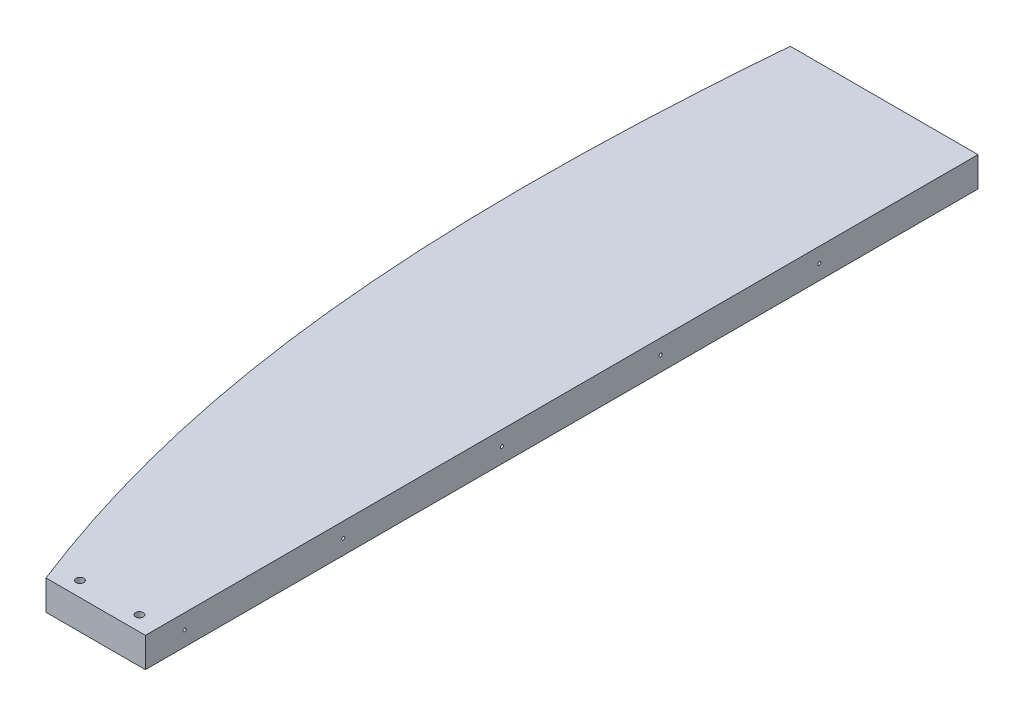
ISO-10303-21;
HEADER;
FILE_DESCRIPTION(('STEP AP214'),'2;1');
FILE_NAME('part.step','',(''),(''),'','','');
FILE_SCHEMA(('AUTOMOTIVE_DESIGN { 1 0 10303 214 1 1 1 1 }'));
ENDSEC;
DATA;
#1=APPLICATION_CONTEXT('core data for automotive mechanical design processes');
#2=APPLICATION_PROTOCOL_DEFINITION('international standard','automotive_design',2000,#1);
#3=PRODUCT_CONTEXT('',#1,'mechanical');
#4=PRODUCT('Part','Part','',(#3));
#5=PRODUCT_RELATED_PRODUCT_CATEGORY('part','',(#4));
#6=PRODUCT_DEFINITION_FORMATION('','',#4);
#7=PRODUCT_DEFINITION_CONTEXT('part definition',#1,'design');
#8=PRODUCT_DEFINITION('design','',#6,#7);
#9=PRODUCT_DEFINITION_SHAPE('','',#8);
#10=(LENGTH_UNIT() NAMED_UNIT(*) SI_UNIT(.MILLI.,.METRE.));
#11=(NAMED_UNIT(*) PLANE_ANGLE_UNIT() SI_UNIT($,.RADIAN.));
#12=(NAMED_UNIT(*) SI_UNIT($,.STERADIAN.) SOLID_ANGLE_UNIT());
#13=UNCERTAINTY_MEASURE_WITH_UNIT(LENGTH_MEASURE(1.E-05),#10,'distance_accuracy_value','');
#14=(GEOMETRIC_REPRESENTATION_CONTEXT(3) GLOBAL_UNCERTAINTY_ASSIGNED_CONTEXT((#13)) GLOBAL_UNIT_ASSIGNED_CONTEXT((#10,
#11,#12)) REPRESENTATION_CONTEXT('',''));
#15=CARTESIAN_POINT('',(0.,0.,0.));
#16=DIRECTION('',(0.,0.,1.));
#17=DIRECTION('',(1.,0.,0.));
#18=AXIS2_PLACEMENT_3D('',#15,#16,#17);
#19=CARTESIAN_POINT('',(-389.5016067869,5194.3,2950.05622050593));
#20=DIRECTION('',(0.,1.,0.));
#21=DIRECTION('',(1.,0.,0.));
#22=AXIS2_PLACEMENT_3D('',#19,#20,#21);
#23=PLANE('',#22);
#24=CARTESIAN_POINT('',(-376.528681754765,5194.3,3207.07744091049));
#25=DIRECTION('',(0.,-1.,0.));
#26=DIRECTION('',(1.,0.,0.));
#27=AXIS2_PLACEMENT_3D('',#24,#25,#26);
#28=CIRCLE('',#27,2.45744999999997);
#29=CARTESIAN_POINT('',(-374.071231754765,5194.3,3207.07744091049));
#30=VERTEX_POINT('',#29);
#31=EDGE_CURVE('E226',#30,#30,#28,.T.);
#32=ORIENTED_EDGE('',*,*,#31,.F.);
#33=EDGE_LOOP('',(#32));
#34=FACE_BOUND('',#33,.T.);
#35=CARTESIAN_POINT('',(-338.428578956982,5194.3,3207.07744091058));
#36=DIRECTION('',(0.,-1.,0.));
#37=DIRECTION('',(1.,0.,0.));
#38=AXIS2_PLACEMENT_3D('',#35,#36,#37);
#39=CIRCLE('',#38,2.45744999999997);
#40=CARTESIAN_POINT('',(-335.971128956982,5194.3,3207.07744091058));
#41=VERTEX_POINT('',#40);
#42=EDGE_CURVE('E44',#41,#41,#39,.T.);
#43=ORIENTED_EDGE('',*,*,#42,.F.);
#44=EDGE_LOOP('',(#43));
#45=FACE_BOUND('',#44,.T.);
#46=DIRECTION('',(1.,0.,0.));
#47=VECTOR('',#46,1.);
#48=CARTESIAN_POINT('',(-445.271141729743,5194.3,2683.51));
#49=LINE('',#48,#47);
#50=CARTESIAN_POINT('',(-445.271141729743,5194.3,2683.51));
#51=VERTEX_POINT('',#50);
#52=CARTESIAN_POINT('',(-325.12,5194.3,2683.51));
#53=VERTEX_POINT('',#52);
#54=EDGE_CURVE('E163',#51,#53,#49,.T.);
#55=ORIENTED_EDGE('',*,*,#54,.T.);
#56=DIRECTION('',(0.,0.,1.));
#57=VECTOR('',#56,1.);
#58=CARTESIAN_POINT('',(-325.12,5194.3,2683.51));
#59=LINE('',#58,#57);
#60=CARTESIAN_POINT('',(-325.12,5194.3,3216.60244101189));
#61=VERTEX_POINT('',#60);
#62=EDGE_CURVE('E179',#53,#61,#59,.T.);
#63=ORIENTED_EDGE('',*,*,#62,.T.);
#64=DIRECTION('',(-1.,0.,0.));
#65=VECTOR('',#64,1.);
#66=CARTESIAN_POINT('',(-325.12,5194.3,3216.60244101189));
#67=LINE('',#66,#65);
#68=CARTESIAN_POINT('',(-388.748833209511,5194.3,3216.60244101189));
#69=VERTEX_POINT('',#68);
#70=EDGE_CURVE('E172',#61,#69,#67,.T.);
#71=ORIENTED_EDGE('',*,*,#70,.T.);
#72=CARTESIAN_POINT('',(-388.748833209511,5194.3,3216.60244101189));
#73=CARTESIAN_POINT('',(-389.522252968133,5194.3,3214.63182176014));
#74=CARTESIAN_POINT('',(-390.28872172435,5194.3,3212.65847358438));
#75=CARTESIAN_POINT('',(-391.807587176832,5194.3,3208.70646110342));
#76=CARTESIAN_POINT('',(-392.559984442724,5194.3,3206.72779701715));
#77=CARTESIAN_POINT('',(-394.050584006538,5194.3,3202.7651760804));
#78=CARTESIAN_POINT('',(-394.788786601797,5194.3,3200.78121934178));
#79=CARTESIAN_POINT('',(-396.251182478671,5194.3,3196.8072370958));
#80=CARTESIAN_POINT('',(-396.975369962835,5194.3,3194.81720945522));
#81=CARTESIAN_POINT('',(-398.409326379544,5194.3,3190.83191533539));
#82=CARTESIAN_POINT('',(-399.119095003551,5194.3,3188.83664874507));
#83=CARTESIAN_POINT('',(-400.524120705957,5194.3,3184.84092335103));
#84=CARTESIAN_POINT('',(-401.219377144053,5194.3,3182.84046432257));
#85=CARTESIAN_POINT('',(-403.979981150922,5194.3,3174.80275179745));
#86=CARTESIAN_POINT('',(-405.986229361711,5194.3,3168.7450562538));
#87=CARTESIAN_POINT('',(-409.864016063092,5194.3,3156.58584521959));
#88=CARTESIAN_POINT('',(-411.735535675615,5194.3,3150.48432371938));
#89=CARTESIAN_POINT('',(-415.342670234217,5194.3,3138.24071743662));
#90=CARTESIAN_POINT('',(-417.078274865979,5194.3,3132.09862961383));
#91=CARTESIAN_POINT('',(-420.413307310401,5194.3,3119.77755039309));
#92=CARTESIAN_POINT('',(-422.012733917511,5194.3,3113.59855866895));
#93=CARTESIAN_POINT('',(-425.076507654872,5194.3,3101.20582036093));
#94=CARTESIAN_POINT('',(-426.540826480792,5194.3,3094.99206678251));
#95=CARTESIAN_POINT('',(-429.335602965528,5194.3,3082.53477442042));
#96=CARTESIAN_POINT('',(-430.666065285989,5194.3,3076.29123668194));
#97=CARTESIAN_POINT('',(-433.195551254198,5194.3,3063.77787947901));
#98=CARTESIAN_POINT('',(-434.394580050255,5194.3,3057.50806105398));
#99=CARTESIAN_POINT('',(-436.664262798693,5194.3,3044.94572418597));
#100=CARTESIAN_POINT('',(-437.734926596352,5194.3,3038.65320752207));
#101=CARTESIAN_POINT('',(-439.412841289309,5194.3,3028.16585891989));
#102=CARTESIAN_POINT('',(-440.054930598951,5194.3,3023.97656044391));
#103=CARTESIAN_POINT('',(-441.285326649012,5194.3,3015.59028760335));
#104=CARTESIAN_POINT('',(-441.87363620708,5194.3,3011.39331365267));
#105=CARTESIAN_POINT('',(-442.997751229943,5194.3,3002.99243079538));
#106=CARTESIAN_POINT('',(-443.533557687155,5194.3,2998.7885220214));
#107=CARTESIAN_POINT('',(-444.553830346814,5194.3,2990.37588429152));
#108=CARTESIAN_POINT('',(-445.038313336257,5194.3,2986.16715736967));
#109=CARTESIAN_POINT('',(-445.95751189761,5194.3,2977.74420167879));
#110=CARTESIAN_POINT('',(-446.392226612659,5194.3,2973.5299728163));
#111=CARTESIAN_POINT('',(-447.213286250906,5194.3,2965.0967391719));
#112=CARTESIAN_POINT('',(-447.599630208291,5194.3,2960.87773429633));
#113=CARTESIAN_POINT('',(-448.610399554395,5194.3,2949.12002029531));
#114=CARTESIAN_POINT('',(-449.183460079722,5194.3,2941.57684955928));
#115=CARTESIAN_POINT('',(-450.188110587307,5194.3,2926.48082596249));
#116=CARTESIAN_POINT('',(-450.61969436184,5194.3,2918.92797269146));
#117=CARTESIAN_POINT('',(-451.167099565232,5194.3,2907.59393388459));
#118=CARTESIAN_POINT('',(-451.332907313244,5194.3,2903.81509221511));
#119=CARTESIAN_POINT('',(-451.632200630418,5194.3,2896.2561191346));
#120=CARTESIAN_POINT('',(-451.765686187028,5194.3,2892.47598772308));
#121=CARTESIAN_POINT('',(-452.001447257515,5194.3,2884.91259385326));
#122=CARTESIAN_POINT('',(-452.103704889071,5194.3,2881.12933084029));
#123=CARTESIAN_POINT('',(-452.277368935585,5194.3,2873.56209999784));
#124=CARTESIAN_POINT('',(-452.348775360838,5194.3,2869.77813216859));
#125=CARTESIAN_POINT('',(-452.462007398326,5194.3,2862.20982426264));
#126=CARTESIAN_POINT('',(-452.503833548246,5194.3,2858.42548419396));
#127=CARTESIAN_POINT('',(-452.558952189985,5194.3,2850.8566043691));
#128=CARTESIAN_POINT('',(-452.572244665883,5194.3,2847.07206461283));
#129=CARTESIAN_POINT('',(-452.570825815497,5194.3,2835.71848246225));
#130=CARTESIAN_POINT('',(-452.51481925408,5194.3,2828.14940488104));
#131=CARTESIAN_POINT('',(-452.325706518357,5194.3,2814.8576360439));
#132=CARTESIAN_POINT('',(-452.21472141439,5194.3,2809.13460593405));
#133=CARTESIAN_POINT('',(-451.936070151197,5194.3,2797.68993762865));
#134=CARTESIAN_POINT('',(-451.768404183397,5194.3,2791.96829942846));
#135=CARTESIAN_POINT('',(-451.378470854025,5194.3,2780.52685123598));
#136=CARTESIAN_POINT('',(-451.156203086375,5194.3,2774.80704125759));
#137=CARTESIAN_POINT('',(-450.658785505362,5194.3,2763.36967450208));
#138=CARTESIAN_POINT('',(-450.383635226401,5194.3,2757.65211774522));
#139=CARTESIAN_POINT('',(-449.782227506015,5194.3,2746.22711571753));
#140=CARTESIAN_POINT('',(-449.456036663211,5194.3,2740.51966693659));
#141=CARTESIAN_POINT('',(-448.75333687339,5194.3,2729.10791697049));
#142=CARTESIAN_POINT('',(-448.376828318642,5194.3,2723.40361576115));
#143=CARTESIAN_POINT('',(-447.574201897389,5194.3,2711.99864715379));
#144=CARTESIAN_POINT('',(-447.148085321016,5194.3,2706.29797966515));
#145=CARTESIAN_POINT('',(-446.471952170237,5194.3,2697.75005038914));
#146=CARTESIAN_POINT('',(-446.240420243813,5194.3,2694.9013153148));
#147=CARTESIAN_POINT('',(-445.765028486666,5194.3,2689.20487423171));
#148=CARTESIAN_POINT('',(-445.521168656989,5194.3,2686.35716822288));
#149=CARTESIAN_POINT('',(-445.271141729743,5194.3,2683.51));
#150=B_SPLINE_CURVE_WITH_KNOTS('',3,(#72,#73,#74,#75,#76,#77,#78,#79,#80,#81,#82,#83,#84,#85,
#86,#87,#88,#89,#90,#91,#92,#93,#94,#95,#96,#97,#98,#99,#100,#101,#102,#103,#104,#105,#106,#107,
#108,#109,#110,#111,#112,#113,#114,#115,#116,#117,#118,#119,#120,#121,#122,#123,#124,#125,#126,
#127,#128,#129,#130,#131,#132,#133,#134,#135,#136,#137,#138,#139,#140,#141,#142,#143,#144,#145,
#146,#147,#148,#149),.UNSPECIFIED.,.F.,.F.,(4,2,2,2,2,2,2,2,2,2,2,2,2,2,2,2,2,2,2,2,2,2,2,2,2,2,
2,2,2,2,2,2,2,2,2,2,2,2,4),(0.,6.35086701356905,12.7014763794555,19.0519525736819,
25.4050018387978,31.758186905569,38.1116516963092,57.2537350240522,76.3984953265151,
95.5447070815523,114.691088315577,133.841471545988,152.991187620061,172.140153323164,
191.287649407017,204.001986076296,216.715656228675,229.429086019741,242.138344550251,
254.847821863679,267.557552904961,290.250765480576,312.944973656978,324.292291318835,
335.639613387368,346.993421240414,358.347225304224,369.700822982525,381.054426996128,
403.761418106075,420.933479573431,438.10548304731,455.277614235263,472.449896620544,
489.599956338762,506.749882365398,523.899362482217,532.473724957063,541.04808670467),.UNSPECIFIED.);
#151=EDGE_CURVE('E170',#69,#51,#150,.T.);
#152=ORIENTED_EDGE('',*,*,#151,.T.);
#153=EDGE_LOOP('',(#55,#63,#71,#152));
#154=FACE_BOUND('',#153,.T.);
#155=ADVANCED_FACE('F37',(#34,#45,#154),#23,.F.);
#156=CARTESIAN_POINT('',(-325.12,5194.3,2683.51));
#157=DIRECTION('',(1.,0.,0.));
#158=DIRECTION('',(0.,-1.,0.));
#159=AXIS2_PLACEMENT_3D('',#156,#157,#158);
#160=PLANE('',#159);
#161=CARTESIAN_POINT('',(-325.12,5203.825,2785.11));
#162=DIRECTION('',(-1.,0.,0.));
#163=DIRECTION('',(0.,-1.,0.));
#164=AXIS2_PLACEMENT_3D('',#161,#162,#163);
#165=CIRCLE('',#164,0.991870000000006);
#166=CARTESIAN_POINT('',(-325.12,5202.83313,2785.11));
#167=VERTEX_POINT('',#166);
#168=EDGE_CURVE('E121',#167,#167,#165,.T.);
#169=ORIENTED_EDGE('',*,*,#168,.T.);
#170=EDGE_LOOP('',(#169));
#171=FACE_BOUND('',#170,.T.);
#172=CARTESIAN_POINT('',(-325.12,5203.825,2886.71));
#173=DIRECTION('',(-1.,0.,0.));
#174=DIRECTION('',(0.,-1.,0.));
#175=AXIS2_PLACEMENT_3D('',#172,#173,#174);
#176=CIRCLE('',#175,0.991870000000006);
#177=CARTESIAN_POINT('',(-325.12,5202.83313,2886.71));
#178=VERTEX_POINT('',#177);
#179=EDGE_CURVE('E132',#178,#178,#176,.T.);
#180=ORIENTED_EDGE('',*,*,#179,.T.);
#181=EDGE_LOOP('',(#180));
#182=FACE_BOUND('',#181,.T.);
#183=CARTESIAN_POINT('',(-325.12,5203.825,2988.31));
#184=DIRECTION('',(-1.,0.,0.));
#185=DIRECTION('',(0.,-1.,0.));
#186=AXIS2_PLACEMENT_3D('',#183,#184,#185);
#187=CIRCLE('',#186,0.991870000000006);
#188=CARTESIAN_POINT('',(-325.12,5202.83313,2988.31));
#189=VERTEX_POINT('',#188);
#190=EDGE_CURVE('E136',#189,#189,#187,.T.);
#191=ORIENTED_EDGE('',*,*,#190,.T.);
#192=EDGE_LOOP('',(#191));
#193=FACE_BOUND('',#192,.T.);
#194=CARTESIAN_POINT('',(-325.12,5203.825,3089.91));
#195=DIRECTION('',(-1.,0.,0.));
#196=DIRECTION('',(0.,-1.,0.));
#197=AXIS2_PLACEMENT_3D('',#194,#195,#196);
#198=CIRCLE('',#197,0.991870000000006);
#199=CARTESIAN_POINT('',(-325.12,5202.83313,3089.91));
#200=VERTEX_POINT('',#199);
#201=EDGE_CURVE('E140',#200,#200,#198,.T.);
#202=ORIENTED_EDGE('',*,*,#201,.T.);
#203=EDGE_LOOP('',(#202));
#204=FACE_BOUND('',#203,.T.);
#205=CARTESIAN_POINT('',(-325.12,5203.825,3191.51));
#206=DIRECTION('',(-1.,0.,0.));
#207=DIRECTION('',(0.,-1.,0.));
#208=AXIS2_PLACEMENT_3D('',#205,#206,#207);
#209=CIRCLE('',#208,0.991870000000006);
#210=CARTESIAN_POINT('',(-325.12,5202.83313,3191.51));
#211=VERTEX_POINT('',#210);
#212=EDGE_CURVE('E144',#211,#211,#209,.T.);
#213=ORIENTED_EDGE('',*,*,#212,.T.);
#214=EDGE_LOOP('',(#213));
#215=FACE_BOUND('',#214,.T.);
#216=DIRECTION('',(0.,0.,1.));
#217=VECTOR('',#216,1.);
#218=CARTESIAN_POINT('',(-325.12,5213.35,2950.05622050593));
#219=LINE('',#218,#217);
#220=CARTESIAN_POINT('',(-325.12,5213.35,2683.51));
#221=VERTEX_POINT('',#220);
#222=CARTESIAN_POINT('',(-325.12,5213.35,3216.60244101189));
#223=VERTEX_POINT('',#222);
#224=EDGE_CURVE('E157',#221,#223,#219,.T.);
#225=ORIENTED_EDGE('',*,*,#224,.T.);
#226=DIRECTION('',(0.,1.,0.));
#227=VECTOR('',#226,1.);
#228=CARTESIAN_POINT('',(-325.12,5194.3,3216.60244101189));
#229=LINE('',#228,#227);
#230=EDGE_CURVE('E80',#223,#61,#229,.F.);
#231=ORIENTED_EDGE('',*,*,#230,.T.);
#232=ORIENTED_EDGE('',*,*,#62,.F.);
#233=DIRECTION('',(0.,1.,0.));
#234=VECTOR('',#233,1.);
#235=CARTESIAN_POINT('',(-325.12,5194.3,2683.51));
#236=LINE('',#235,#234);
#237=EDGE_CURVE('E91',#53,#221,#236,.T.);
#238=ORIENTED_EDGE('',*,*,#237,.T.);
#239=EDGE_LOOP('',(#225,#231,#232,#238));
#240=FACE_BOUND('',#239,.T.);
#241=ADVANCED_FACE('F215',(#171,#182,#193,#204,#215,#240),#160,.T.);
#242=CARTESIAN_POINT('',(-325.12,5194.3,3216.60244101189));
#243=DIRECTION('',(0.,0.,1.));
#244=DIRECTION('',(-1.,0.,0.));
#245=AXIS2_PLACEMENT_3D('',#242,#243,#244);
#246=PLANE('',#245);
#247=DIRECTION('',(1.,0.,0.));
#248=VECTOR('',#247,1.);
#249=CARTESIAN_POINT('',(-389.5016067869,5213.35,3216.60244101189));
#250=LINE('',#249,#248);
#251=CARTESIAN_POINT('',(-388.748833209508,5213.35,3216.60244101189));
#252=VERTEX_POINT('',#251);
#253=EDGE_CURVE('E155',#223,#252,#250,.F.);
#254=ORIENTED_EDGE('',*,*,#253,.T.);
#255=DIRECTION('',(-1.36956646082368E-13,-1.,0.));
#256=VECTOR('',#255,1.);
#257=CARTESIAN_POINT('',(-388.74883320951,5203.825,3216.60244101189));
#258=LINE('',#257,#256);
#259=EDGE_CURVE('E69',#252,#69,#258,.T.);
#260=ORIENTED_EDGE('',*,*,#259,.T.);
#261=ORIENTED_EDGE('',*,*,#70,.F.);
#262=ORIENTED_EDGE('',*,*,#230,.F.);
#263=EDGE_LOOP('',(#254,#260,#261,#262));
#264=FACE_BOUND('',#263,.T.);
#265=ADVANCED_FACE('F212',(#264),#246,.T.);
#266=CARTESIAN_POINT('',(-388.748833209511,5194.3,3216.60244101189));
#267=CARTESIAN_POINT('',(-388.748833209509,5213.35,3216.60244101189));
#268=CARTESIAN_POINT('',(-427.32827456289,5194.3,3118.30445867764));
#269=CARTESIAN_POINT('',(-427.32827456289,5213.35,3118.30445867764));
#270=CARTESIAN_POINT('',(-448.538626648826,5194.3,3013.430965814));
#271=CARTESIAN_POINT('',(-448.538626648824,5213.35,3013.430965814));
#272=CARTESIAN_POINT('',(-453.87526066603,5194.3,2815.15896694759));
#273=CARTESIAN_POINT('',(-453.875260666027,5213.35,2815.15896694759));
#274=CARTESIAN_POINT('',(-450.72161494878,5194.3,2745.57602142326));
#275=CARTESIAN_POINT('',(-450.721614948777,5213.35,2745.57602142326));
#276=CARTESIAN_POINT('',(-445.271141729743,5194.3,2683.51));
#277=CARTESIAN_POINT('',(-445.271141729743,5213.35,2683.51));
#278=B_SPLINE_SURFACE_WITH_KNOTS('',3,1,((#266,#267),(#268,#269),(#270,#271),(#272,#273),(#274,
#275),(#276,#277)),.UNSPECIFIED.,.F.,.F.,.F.,(4,2,4),(2,2),(-53.1349686655124,-24.0856941468216,
-9.03456928373366),(0.,1.90499999999997),.UNSPECIFIED.);
#279=CARTESIAN_POINT('',(-388.748833209509,5213.35,3216.60244101189));
#280=CARTESIAN_POINT('',(-389.522252968131,5213.35,3214.63182176014));
#281=CARTESIAN_POINT('',(-390.288721724347,5213.35,3212.65847358438));
#282=CARTESIAN_POINT('',(-391.807587176829,5213.35,3208.70646110342));
#283=CARTESIAN_POINT('',(-392.559984442721,5213.35,3206.72779701715));
#284=CARTESIAN_POINT('',(-394.050584006536,5213.35,3202.7651760804));
#285=CARTESIAN_POINT('',(-394.788786601795,5213.35,3200.78121934178));
#286=CARTESIAN_POINT('',(-396.251182478668,5213.35,3196.8072370958));
#287=CARTESIAN_POINT('',(-396.975369962833,5213.35,3194.81720945522));
#288=CARTESIAN_POINT('',(-398.409326379543,5213.35,3190.8319153354));
#289=CARTESIAN_POINT('',(-399.119095003549,5213.35,3188.83664874507));
#290=CARTESIAN_POINT('',(-400.524120705955,5213.35,3184.84092335103));
#291=CARTESIAN_POINT('',(-401.219377144051,5213.35,3182.84046432257));
#292=CARTESIAN_POINT('',(-403.979981150921,5213.35,3174.80275179745));
#293=CARTESIAN_POINT('',(-405.986229361709,5213.35,3168.7450562538));
#294=CARTESIAN_POINT('',(-409.86401606309,5213.35,3156.58584521959));
#295=CARTESIAN_POINT('',(-411.735535675613,5213.35,3150.48432371939));
#296=CARTESIAN_POINT('',(-415.342670234215,5213.35,3138.24071743662));
#297=CARTESIAN_POINT('',(-417.078274865977,5213.35,3132.09862961383));
#298=CARTESIAN_POINT('',(-420.413307310399,5213.35,3119.77755039309));
#299=CARTESIAN_POINT('',(-422.012733917509,5213.35,3113.59855866895));
#300=CARTESIAN_POINT('',(-425.07650765487,5213.35,3101.20582036093));
#301=CARTESIAN_POINT('',(-426.540826480791,5213.35,3094.99206678251));
#302=CARTESIAN_POINT('',(-429.335602965527,5213.35,3082.53477442042));
#303=CARTESIAN_POINT('',(-430.666065285987,5213.35,3076.29123668194));
#304=CARTESIAN_POINT('',(-433.195551254196,5213.35,3063.77787947901));
#305=CARTESIAN_POINT('',(-434.394580050254,5213.35,3057.50806105398));
#306=CARTESIAN_POINT('',(-436.664262798691,5213.35,3044.94572418597));
#307=CARTESIAN_POINT('',(-437.734926596351,5213.35,3038.65320752207));
#308=CARTESIAN_POINT('',(-439.412841289306,5213.35,3028.16585891989));
#309=CARTESIAN_POINT('',(-440.054930598949,5213.35,3023.97656044391));
#310=CARTESIAN_POINT('',(-441.28532664901,5213.35,3015.59028760335));
#311=CARTESIAN_POINT('',(-441.873636207078,5213.35,3011.39331365267));
#312=CARTESIAN_POINT('',(-442.997751229941,5213.35,3002.99243079538));
#313=CARTESIAN_POINT('',(-443.533557687153,5213.35,2998.7885220214));
#314=CARTESIAN_POINT('',(-444.553830346812,5213.35,2990.37588429152));
#315=CARTESIAN_POINT('',(-445.038313336254,5213.35,2986.16715736967));
#316=CARTESIAN_POINT('',(-445.957511897608,5213.35,2977.74420167879));
#317=CARTESIAN_POINT('',(-446.392226612657,5213.35,2973.5299728163));
#318=CARTESIAN_POINT('',(-447.213286250903,5213.35,2965.0967391719));
#319=CARTESIAN_POINT('',(-447.599630208289,5213.35,2960.87773429633));
#320=CARTESIAN_POINT('',(-448.610399554392,5213.35,2949.12002029531));
#321=CARTESIAN_POINT('',(-449.18346007972,5213.35,2941.57684955928));
#322=CARTESIAN_POINT('',(-450.188110587305,5213.35,2926.48082596249));
#323=CARTESIAN_POINT('',(-450.619694361838,5213.35,2918.92797269146));
#324=CARTESIAN_POINT('',(-451.167099565229,5213.35,2907.5939338846));
#325=CARTESIAN_POINT('',(-451.332907313242,5213.35,2903.81509221511));
#326=CARTESIAN_POINT('',(-451.632200630416,5213.35,2896.2561191346));
#327=CARTESIAN_POINT('',(-451.765686187025,5213.35,2892.47598772308));
#328=CARTESIAN_POINT('',(-452.001447257512,5213.35,2884.91259385326));
#329=CARTESIAN_POINT('',(-452.103704889069,5213.35,2881.12933084029));
#330=CARTESIAN_POINT('',(-452.277368935582,5213.35,2873.56209999784));
#331=CARTESIAN_POINT('',(-452.348775360836,5213.35,2869.77813216859));
#332=CARTESIAN_POINT('',(-452.462007398323,5213.35,2862.20982426264));
#333=CARTESIAN_POINT('',(-452.503833548243,5213.35,2858.42548419396));
#334=CARTESIAN_POINT('',(-452.558952189982,5213.35,2850.8566043691));
#335=CARTESIAN_POINT('',(-452.57224466588,5213.35,2847.07206461283));
#336=CARTESIAN_POINT('',(-452.570825815494,5213.35,2835.71848246225));
#337=CARTESIAN_POINT('',(-452.514819254078,5213.35,2828.14940488104));
#338=CARTESIAN_POINT('',(-452.325706518355,5213.35,2814.8576360439));
#339=CARTESIAN_POINT('',(-452.214721414387,5213.35,2809.13460593405));
#340=CARTESIAN_POINT('',(-451.936070151195,5213.35,2797.68993762865));
#341=CARTESIAN_POINT('',(-451.768404183394,5213.35,2791.96829942846));
#342=CARTESIAN_POINT('',(-451.378470854023,5213.35,2780.52685123598));
#343=CARTESIAN_POINT('',(-451.156203086373,5213.35,2774.80704125759));
#344=CARTESIAN_POINT('',(-450.65878550536,5213.35,2763.36967450208));
#345=CARTESIAN_POINT('',(-450.383635226399,5213.35,2757.65211774522));
#346=CARTESIAN_POINT('',(-449.782227506013,5213.35,2746.22711571753));
#347=CARTESIAN_POINT('',(-449.45603666321,5213.35,2740.51966693659));
#348=CARTESIAN_POINT('',(-448.753336873389,5213.35,2729.10791697049));
#349=CARTESIAN_POINT('',(-448.376828318641,5213.35,2723.40361576115));
#350=CARTESIAN_POINT('',(-447.574201897389,5213.35,2711.99864715379));
#351=CARTESIAN_POINT('',(-447.148085321015,5213.35,2706.29797966515));
#352=CARTESIAN_POINT('',(-446.471952170236,5213.35,2697.75005038914));
#353=CARTESIAN_POINT('',(-446.240420243812,5213.35,2694.9013153148));
#354=CARTESIAN_POINT('',(-445.765028486666,5213.35,2689.20487423171));
#355=CARTESIAN_POINT('',(-445.521168656989,5213.35,2686.35716822288));
#356=CARTESIAN_POINT('',(-445.271141729743,5213.35,2683.51));
#357=B_SPLINE_CURVE_WITH_KNOTS('',3,(#279,#280,#281,#282,#283,#284,#285,#286,#287,#288,#289,
#290,#291,#292,#293,#294,#295,#296,#297,#298,#299,#300,#301,#302,#303,#304,#305,#306,#307,#308,
#309,#310,#311,#312,#313,#314,#315,#316,#317,#318,#319,#320,#321,#322,#323,#324,#325,#326,#327,
#328,#329,#330,#331,#332,#333,#334,#335,#336,#337,#338,#339,#340,#341,#342,#343,#344,#345,#346,
#347,#348,#349,#350,#351,#352,#353,#354,#355,#356),.UNSPECIFIED.,.F.,.F.,(4,2,2,2,2,2,2,2,2,2,2,
2,2,2,2,2,2,2,2,2,2,2,2,2,2,2,2,2,2,2,2,2,2,2,2,2,2,2,4),(0.,6.350867013569,12.7014763794554,
19.0519525736821,25.4050018387976,31.7581869055693,38.1116516963095,57.2537350240521,
76.3984953265144,95.5447070815521,114.691088315577,133.841471545987,152.991187620061,
172.140153323164,191.287649407017,204.001986076297,216.715656228674,229.42908601974,
242.138344550251,254.847821863678,267.55755290496,290.250765480575,312.944973656977,
324.292291318834,335.639613387368,346.993421240414,358.347225304224,369.700822982525,
381.054426996129,403.761418106075,420.933479573431,438.10548304731,455.277614235263,
472.449896620544,489.599956338762,506.749882365399,523.899362482218,532.473724957063,
541.04808670467),.UNSPECIFIED.);
#358=CARTESIAN_POINT('',(-445.271141729743,5213.35,2683.51));
#359=VERTEX_POINT('',#358);
#360=EDGE_CURVE('E50',#252,#359,#357,.T.);
#361=DIRECTION('',(0.,1.,0.));
#362=VECTOR('',#361,1.);
#363=CARTESIAN_POINT('',(-445.271141729743,5194.3,2683.51));
#364=LINE('',#363,#362);
#365=EDGE_CURVE('E160',#359,#51,#364,.F.);
#366=ORIENTED_EDGE('',*,*,#360,.T.);
#367=ORIENTED_EDGE('',*,*,#365,.T.);
#368=ORIENTED_EDGE('',*,*,#151,.F.);
#369=ORIENTED_EDGE('',*,*,#259,.F.);
#370=EDGE_LOOP('',(#366,#367,#368,#369));
#371=FACE_BOUND('',#370,.T.);
#372=ADVANCED_FACE('F39',(#371),#278,.F.);
#373=CARTESIAN_POINT('',(-445.271141729743,5194.3,2683.51));
#374=DIRECTION('',(0.,0.,-1.));
#375=DIRECTION('',(1.,0.,0.));
#376=AXIS2_PLACEMENT_3D('',#373,#374,#375);
#377=PLANE('',#376);
#378=CARTESIAN_POINT('',(-414.990074060502,5203.825,2683.51));
#379=DIRECTION('',(0.,0.,1.));
#380=DIRECTION('',(1.,0.,0.));
#381=AXIS2_PLACEMENT_3D('',#378,#379,#380);
#382=CIRCLE('',#381,0.991870000000006);
#383=CARTESIAN_POINT('',(-413.998204060502,5203.825,2683.51));
#384=VERTEX_POINT('',#383);
#385=EDGE_CURVE('E148',#384,#384,#382,.T.);
#386=ORIENTED_EDGE('',*,*,#385,.T.);
#387=EDGE_LOOP('',(#386));
#388=FACE_BOUND('',#387,.T.);
#389=CARTESIAN_POINT('',(-355.076691353501,5203.825,2683.51));
#390=DIRECTION('',(0.,0.,1.));
#391=DIRECTION('',(1.,0.,0.));
#392=AXIS2_PLACEMENT_3D('',#389,#390,#391);
#393=CIRCLE('',#392,0.991870000000006);
#394=CARTESIAN_POINT('',(-354.084821353501,5203.825,2683.51));
#395=VERTEX_POINT('',#394);
#396=EDGE_CURVE('E151',#395,#395,#393,.T.);
#397=ORIENTED_EDGE('',*,*,#396,.T.);
#398=EDGE_LOOP('',(#397));
#399=FACE_BOUND('',#398,.T.);
#400=DIRECTION('',(1.,0.,0.));
#401=VECTOR('',#400,1.);
#402=CARTESIAN_POINT('',(-389.5016067869,5213.35,2683.51));
#403=LINE('',#402,#401);
#404=EDGE_CURVE('E11',#359,#221,#403,.T.);
#405=ORIENTED_EDGE('',*,*,#404,.T.);
#406=ORIENTED_EDGE('',*,*,#237,.F.);
#407=ORIENTED_EDGE('',*,*,#54,.F.);
#408=ORIENTED_EDGE('',*,*,#365,.F.);
#409=EDGE_LOOP('',(#405,#406,#407,#408));
#410=FACE_BOUND('',#409,.T.);
#411=ADVANCED_FACE('F206',(#388,#399,#410),#377,.T.);
#412=CARTESIAN_POINT('',(-389.5016067869,5213.35,2950.05622050593));
#413=DIRECTION('',(0.,1.,0.));
#414=DIRECTION('',(1.,0.,0.));
#415=AXIS2_PLACEMENT_3D('',#412,#413,#414);
#416=PLANE('',#415);
#417=CARTESIAN_POINT('',(-376.528681754765,5213.35,3207.07744091049));
#418=DIRECTION('',(0.,-1.,0.));
#419=DIRECTION('',(0.,0.,1.));
#420=AXIS2_PLACEMENT_3D('',#417,#418,#419);
#421=CIRCLE('',#420,2.45744999999997);
#422=CARTESIAN_POINT('',(-376.528681754765,5213.35,3209.53489091049));
#423=VERTEX_POINT('',#422);
#424=EDGE_CURVE('E420',#423,#423,#421,.T.);
#425=ORIENTED_EDGE('',*,*,#424,.T.);
#426=EDGE_LOOP('',(#425));
#427=FACE_BOUND('',#426,.T.);
#428=CARTESIAN_POINT('',(-338.428578956982,5213.35,3207.07744091058));
#429=DIRECTION('',(0.,-1.,0.));
#430=DIRECTION('',(0.,0.,1.));
#431=AXIS2_PLACEMENT_3D('',#428,#429,#430);
#432=CIRCLE('',#431,2.45744999999997);
#433=CARTESIAN_POINT('',(-338.428578956982,5213.35,3209.53489091058));
#434=VERTEX_POINT('',#433);
#435=EDGE_CURVE('E126',#434,#434,#432,.T.);
#436=ORIENTED_EDGE('',*,*,#435,.T.);
#437=EDGE_LOOP('',(#436));
#438=FACE_BOUND('',#437,.T.);
#439=ORIENTED_EDGE('',*,*,#360,.F.);
#440=ORIENTED_EDGE('',*,*,#253,.F.);
#441=ORIENTED_EDGE('',*,*,#224,.F.);
#442=ORIENTED_EDGE('',*,*,#404,.F.);
#443=EDGE_LOOP('',(#439,#440,#441,#442));
#444=FACE_BOUND('',#443,.T.);
#445=ADVANCED_FACE('F200',(#427,#438,#444),#416,.T.);
#446=CARTESIAN_POINT('',(-355.076691353501,5203.825,2702.56));
#447=DIRECTION('',(0.,0.,-1.));
#448=DIRECTION('',(1.,0.,0.));
#449=AXIS2_PLACEMENT_3D('',#446,#447,#448);
#450=CONICAL_SURFACE('',#449,0.991870000000006,1.02974425867677);
#451=CARTESIAN_POINT('',(-355.076691353501,5203.825,2703.1559756222));
#452=VERTEX_POINT('',#451);
#453=VERTEX_LOOP('',#452);
#454=FACE_BOUND('',#453,.T.);
#455=CARTESIAN_POINT('',(-355.076691353501,5203.825,2702.56));
#456=DIRECTION('',(0.,0.,1.));
#457=DIRECTION('',(1.,0.,0.));
#458=AXIS2_PLACEMENT_3D('',#455,#456,#457);
#459=CIRCLE('',#458,0.991870000000006);
#460=CARTESIAN_POINT('',(-354.084821353501,5203.825,2702.56));
#461=VERTEX_POINT('',#460);
#462=EDGE_CURVE('E149',#461,#461,#459,.T.);
#463=ORIENTED_EDGE('',*,*,#462,.F.);
#464=EDGE_LOOP('',(#463));
#465=FACE_BOUND('',#464,.T.);
#466=ADVANCED_FACE('F205',(#454,#465),#450,.F.);
#467=CARTESIAN_POINT('',(-355.076691353501,5203.825,2664.46));
#468=DIRECTION('',(0.,0.,-1.));
#469=DIRECTION('',(1.,0.,0.));
#470=AXIS2_PLACEMENT_3D('',#467,#468,#469);
#471=CYLINDRICAL_SURFACE('',#470,0.991870000000006);
#472=ORIENTED_EDGE('',*,*,#396,.F.);
#473=EDGE_LOOP('',(#472));
#474=FACE_BOUND('',#473,.T.);
#475=ORIENTED_EDGE('',*,*,#462,.T.);
#476=EDGE_LOOP('',(#475));
#477=FACE_BOUND('',#476,.T.);
#478=ADVANCED_FACE('F250',(#474,#477),#471,.F.);
#479=CARTESIAN_POINT('',(-414.990074060502,5203.825,2702.56));
#480=DIRECTION('',(0.,0.,-1.));
#481=DIRECTION('',(1.,0.,0.));
#482=AXIS2_PLACEMENT_3D('',#479,#480,#481);
#483=CONICAL_SURFACE('',#482,0.991870000000006,1.02974425867677);
#484=CARTESIAN_POINT('',(-414.990074060502,5203.825,2703.1559756222));
#485=VERTEX_POINT('',#484);
#486=VERTEX_LOOP('',#485);
#487=FACE_BOUND('',#486,.T.);
#488=CARTESIAN_POINT('',(-414.990074060502,5203.825,2702.56));
#489=DIRECTION('',(0.,0.,1.));
#490=DIRECTION('',(1.,0.,0.));
#491=AXIS2_PLACEMENT_3D('',#488,#489,#490);
#492=CIRCLE('',#491,0.991870000000006);
#493=CARTESIAN_POINT('',(-413.998204060502,5203.825,2702.56));
#494=VERTEX_POINT('',#493);
#495=EDGE_CURVE('E145',#494,#494,#492,.T.);
#496=ORIENTED_EDGE('',*,*,#495,.F.);
#497=EDGE_LOOP('',(#496));
#498=FACE_BOUND('',#497,.T.);
#499=ADVANCED_FACE('F257',(#487,#498),#483,.F.);
#500=CARTESIAN_POINT('',(-414.990074060502,5203.825,2664.46));
#501=DIRECTION('',(0.,0.,-1.));
#502=DIRECTION('',(1.,0.,0.));
#503=AXIS2_PLACEMENT_3D('',#500,#501,#502);
#504=CYLINDRICAL_SURFACE('',#503,0.991870000000006);
#505=ORIENTED_EDGE('',*,*,#385,.F.);
#506=EDGE_LOOP('',(#505));
#507=FACE_BOUND('',#506,.T.);
#508=ORIENTED_EDGE('',*,*,#495,.T.);
#509=EDGE_LOOP('',(#508));
#510=FACE_BOUND('',#509,.T.);
#511=ADVANCED_FACE('F264',(#507,#510),#504,.F.);
#512=CARTESIAN_POINT('',(-344.17,5203.825,3191.51));
#513=DIRECTION('',(1.,0.,0.));
#514=DIRECTION('',(0.,0.,1.));
#515=AXIS2_PLACEMENT_3D('',#512,#513,#514);
#516=CONICAL_SURFACE('',#515,0.991870000000006,1.02974425867665);
#517=CARTESIAN_POINT('',(-344.765975622195,5203.825,3191.51));
#518=VERTEX_POINT('',#517);
#519=VERTEX_LOOP('',#518);
#520=FACE_BOUND('',#519,.T.);
#521=CARTESIAN_POINT('',(-344.17,5203.825,3191.51));
#522=DIRECTION('',(-1.,0.,0.));
#523=DIRECTION('',(0.,0.,1.));
#524=AXIS2_PLACEMENT_3D('',#521,#522,#523);
#525=CIRCLE('',#524,0.991870000000006);
#526=CARTESIAN_POINT('',(-344.17,5203.825,3192.50187));
#527=VERTEX_POINT('',#526);
#528=EDGE_CURVE('E141',#527,#527,#525,.T.);
#529=ORIENTED_EDGE('',*,*,#528,.F.);
#530=EDGE_LOOP('',(#529));
#531=FACE_BOUND('',#530,.T.);
#532=ADVANCED_FACE('F272',(#520,#531),#516,.F.);
#533=CARTESIAN_POINT('',(-312.42,5203.825,3191.51));
#534=DIRECTION('',(1.,0.,0.));
#535=DIRECTION('',(0.,0.,1.));
#536=AXIS2_PLACEMENT_3D('',#533,#534,#535);
#537=CYLINDRICAL_SURFACE('',#536,0.991870000000006);
#538=ORIENTED_EDGE('',*,*,#212,.F.);
#539=EDGE_LOOP('',(#538));
#540=FACE_BOUND('',#539,.T.);
#541=ORIENTED_EDGE('',*,*,#528,.T.);
#542=EDGE_LOOP('',(#541));
#543=FACE_BOUND('',#542,.T.);
#544=ADVANCED_FACE('F280',(#540,#543),#537,.F.);
#545=CARTESIAN_POINT('',(-344.17,5203.825,3089.91));
#546=DIRECTION('',(1.,0.,0.));
#547=DIRECTION('',(0.,0.,1.));
#548=AXIS2_PLACEMENT_3D('',#545,#546,#547);
#549=CONICAL_SURFACE('',#548,0.991870000000006,1.02974425867665);
#550=CARTESIAN_POINT('',(-344.765975622195,5203.825,3089.91));
#551=VERTEX_POINT('',#550);
#552=VERTEX_LOOP('',#551);
#553=FACE_BOUND('',#552,.T.);
#554=CARTESIAN_POINT('',(-344.17,5203.825,3089.91));
#555=DIRECTION('',(-1.,0.,0.));
#556=DIRECTION('',(0.,0.,1.));
#557=AXIS2_PLACEMENT_3D('',#554,#555,#556);
#558=CIRCLE('',#557,0.991870000000006);
#559=CARTESIAN_POINT('',(-344.17,5203.825,3090.90187));
#560=VERTEX_POINT('',#559);
#561=EDGE_CURVE('E137',#560,#560,#558,.T.);
#562=ORIENTED_EDGE('',*,*,#561,.F.);
#563=EDGE_LOOP('',(#562));
#564=FACE_BOUND('',#563,.T.);
#565=ADVANCED_FACE('F288',(#553,#564),#549,.F.);
#566=CARTESIAN_POINT('',(-312.42,5203.825,3089.91));
#567=DIRECTION('',(1.,0.,0.));
#568=DIRECTION('',(0.,0.,1.));
#569=AXIS2_PLACEMENT_3D('',#566,#567,#568);
#570=CYLINDRICAL_SURFACE('',#569,0.991870000000006);
#571=ORIENTED_EDGE('',*,*,#201,.F.);
#572=EDGE_LOOP('',(#571));
#573=FACE_BOUND('',#572,.T.);
#574=ORIENTED_EDGE('',*,*,#561,.T.);
#575=EDGE_LOOP('',(#574));
#576=FACE_BOUND('',#575,.T.);
#577=ADVANCED_FACE('F296',(#573,#576),#570,.F.);
#578=CARTESIAN_POINT('',(-344.17,5203.825,2988.31));
#579=DIRECTION('',(1.,0.,0.));
#580=DIRECTION('',(0.,0.,1.));
#581=AXIS2_PLACEMENT_3D('',#578,#579,#580);
#582=CONICAL_SURFACE('',#581,0.991870000000006,1.02974425867665);
#583=CARTESIAN_POINT('',(-344.765975622195,5203.825,2988.31));
#584=VERTEX_POINT('',#583);
#585=VERTEX_LOOP('',#584);
#586=FACE_BOUND('',#585,.T.);
#587=CARTESIAN_POINT('',(-344.17,5203.825,2988.31));
#588=DIRECTION('',(-1.,0.,0.));
#589=DIRECTION('',(0.,0.,1.));
#590=AXIS2_PLACEMENT_3D('',#587,#588,#589);
#591=CIRCLE('',#590,0.991870000000006);
#592=CARTESIAN_POINT('',(-344.17,5203.825,2989.30187));
#593=VERTEX_POINT('',#592);
#594=EDGE_CURVE('E133',#593,#593,#591,.T.);
#595=ORIENTED_EDGE('',*,*,#594,.F.);
#596=EDGE_LOOP('',(#595));
#597=FACE_BOUND('',#596,.T.);
#598=ADVANCED_FACE('F304',(#586,#597),#582,.F.);
#599=CARTESIAN_POINT('',(-312.42,5203.825,2988.31));
#600=DIRECTION('',(1.,0.,0.));
#601=DIRECTION('',(0.,0.,1.));
#602=AXIS2_PLACEMENT_3D('',#599,#600,#601);
#603=CYLINDRICAL_SURFACE('',#602,0.991870000000006);
#604=ORIENTED_EDGE('',*,*,#190,.F.);
#605=EDGE_LOOP('',(#604));
#606=FACE_BOUND('',#605,.T.);
#607=ORIENTED_EDGE('',*,*,#594,.T.);
#608=EDGE_LOOP('',(#607));
#609=FACE_BOUND('',#608,.T.);
#610=ADVANCED_FACE('F312',(#606,#609),#603,.F.);
#611=CARTESIAN_POINT('',(-344.17,5203.825,2886.71));
#612=DIRECTION('',(1.,0.,0.));
#613=DIRECTION('',(0.,0.,1.));
#614=AXIS2_PLACEMENT_3D('',#611,#612,#613);
#615=CONICAL_SURFACE('',#614,0.991870000000006,1.02974425867665);
#616=CARTESIAN_POINT('',(-344.765975622195,5203.825,2886.71));
#617=VERTEX_POINT('',#616);
#618=VERTEX_LOOP('',#617);
#619=FACE_BOUND('',#618,.T.);
#620=CARTESIAN_POINT('',(-344.17,5203.825,2886.71));
#621=DIRECTION('',(-1.,0.,0.));
#622=DIRECTION('',(0.,0.,1.));
#623=AXIS2_PLACEMENT_3D('',#620,#621,#622);
#624=CIRCLE('',#623,0.991870000000006);
#625=CARTESIAN_POINT('',(-344.17,5203.825,2887.70187));
#626=VERTEX_POINT('',#625);
#627=EDGE_CURVE('E124',#626,#626,#624,.T.);
#628=ORIENTED_EDGE('',*,*,#627,.F.);
#629=EDGE_LOOP('',(#628));
#630=FACE_BOUND('',#629,.T.);
#631=ADVANCED_FACE('F320',(#619,#630),#615,.F.);
#632=CARTESIAN_POINT('',(-312.42,5203.825,2886.71));
#633=DIRECTION('',(1.,0.,0.));
#634=DIRECTION('',(0.,0.,1.));
#635=AXIS2_PLACEMENT_3D('',#632,#633,#634);
#636=CYLINDRICAL_SURFACE('',#635,0.991870000000006);
#637=ORIENTED_EDGE('',*,*,#179,.F.);
#638=EDGE_LOOP('',(#637));
#639=FACE_BOUND('',#638,.T.);
#640=ORIENTED_EDGE('',*,*,#627,.T.);
#641=EDGE_LOOP('',(#640));
#642=FACE_BOUND('',#641,.T.);
#643=ADVANCED_FACE('F115',(#639,#642),#636,.F.);
#644=CARTESIAN_POINT('',(-344.17,5203.825,2785.11));
#645=DIRECTION('',(1.,0.,0.));
#646=DIRECTION('',(0.,0.,1.));
#647=AXIS2_PLACEMENT_3D('',#644,#645,#646);
#648=CONICAL_SURFACE('',#647,0.991870000000006,1.02974425867665);
#649=CARTESIAN_POINT('',(-344.765975622195,5203.825,2785.11));
#650=VERTEX_POINT('',#649);
#651=VERTEX_LOOP('',#650);
#652=FACE_BOUND('',#651,.T.);
#653=CARTESIAN_POINT('',(-344.17,5203.825,2785.11));
#654=DIRECTION('',(-1.,0.,0.));
#655=DIRECTION('',(0.,0.,1.));
#656=AXIS2_PLACEMENT_3D('',#653,#654,#655);
#657=CIRCLE('',#656,0.991870000000006);
#658=CARTESIAN_POINT('',(-344.17,5203.825,2786.10187));
#659=VERTEX_POINT('',#658);
#660=EDGE_CURVE('E119',#659,#659,#657,.T.);
#661=ORIENTED_EDGE('',*,*,#660,.F.);
#662=EDGE_LOOP('',(#661));
#663=FACE_BOUND('',#662,.T.);
#664=ADVANCED_FACE('F111',(#652,#663),#648,.F.);
#665=CARTESIAN_POINT('',(-312.42,5203.825,2785.11));
#666=DIRECTION('',(1.,0.,0.));
#667=DIRECTION('',(0.,0.,1.));
#668=AXIS2_PLACEMENT_3D('',#665,#666,#667);
#669=CYLINDRICAL_SURFACE('',#668,0.991870000000006);
#670=ORIENTED_EDGE('',*,*,#168,.F.);
#671=EDGE_LOOP('',(#670));
#672=FACE_BOUND('',#671,.T.);
#673=ORIENTED_EDGE('',*,*,#660,.T.);
#674=EDGE_LOOP('',(#673));
#675=FACE_BOUND('',#674,.T.);
#676=ADVANCED_FACE('F114',(#672,#675),#669,.F.);
#677=CARTESIAN_POINT('',(-338.428578956982,5213.35,3207.07744091058));
#678=DIRECTION('',(0.,1.,0.));
#679=DIRECTION('',(0.,0.,1.));
#680=AXIS2_PLACEMENT_3D('',#677,#678,#679);
#681=CYLINDRICAL_SURFACE('',#680,2.45744999999997);
#682=ORIENTED_EDGE('',*,*,#435,.F.);
#683=EDGE_LOOP('',(#682));
#684=FACE_BOUND('',#683,.T.);
#685=ORIENTED_EDGE('',*,*,#42,.T.);
#686=EDGE_LOOP('',(#685));
#687=FACE_BOUND('',#686,.T.);
#688=ADVANCED_FACE('F346',(#684,#687),#681,.F.);
#689=CARTESIAN_POINT('',(-376.528681754765,5213.35,3207.07744091049));
#690=DIRECTION('',(0.,1.,0.));
#691=DIRECTION('',(0.,0.,1.));
#692=AXIS2_PLACEMENT_3D('',#689,#690,#691);
#693=CYLINDRICAL_SURFACE('',#692,2.45744999999997);
#694=ORIENTED_EDGE('',*,*,#424,.F.);
#695=EDGE_LOOP('',(#694));
#696=FACE_BOUND('',#695,.T.);
#697=ORIENTED_EDGE('',*,*,#31,.T.);
#698=EDGE_LOOP('',(#697));
#699=FACE_BOUND('',#698,.T.);
#700=ADVANCED_FACE('F354',(#696,#699),#693,.F.);
#701=CLOSED_SHELL('',(#155,#241,#265,#372,#411,#445,#466,#478,#499,#511,#532,#544,#565,#577,
#598,#610,#631,#643,#664,#676,#688,#700));
#702=MANIFOLD_SOLID_BREP('B2',#701);
#703=ADVANCED_BREP_SHAPE_REPRESENTATION('',(#18,#702),#14);
#704=SHAPE_DEFINITION_REPRESENTATION(#9,#703);
ENDSEC;
END-ISO-10303-21;
